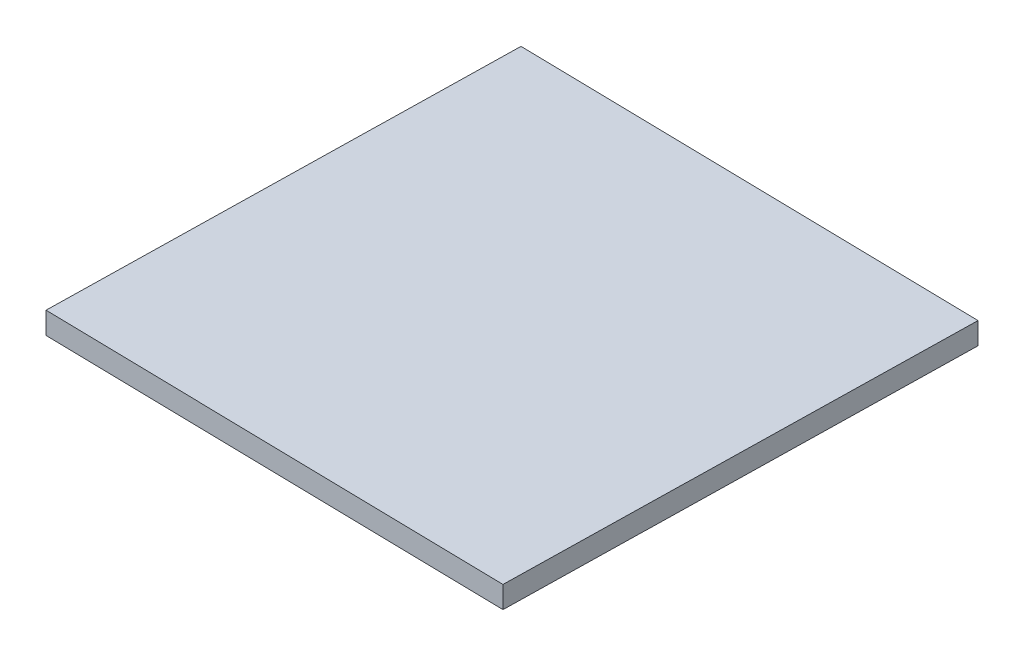
ISO-10303-21;
HEADER;
FILE_DESCRIPTION(('STEP AP214'),'2;1');
FILE_NAME('part.step','',(''),(''),'','','');
FILE_SCHEMA(('AUTOMOTIVE_DESIGN { 1 0 10303 214 1 1 1 1 }'));
ENDSEC;
DATA;
#1=APPLICATION_CONTEXT('core data for automotive mechanical design processes');
#2=APPLICATION_PROTOCOL_DEFINITION('international standard','automotive_design',2000,#1);
#3=PRODUCT_CONTEXT('',#1,'mechanical');
#4=PRODUCT('Part','Part','',(#3));
#5=PRODUCT_RELATED_PRODUCT_CATEGORY('part','',(#4));
#6=PRODUCT_DEFINITION_FORMATION('','',#4);
#7=PRODUCT_DEFINITION_CONTEXT('part definition',#1,'design');
#8=PRODUCT_DEFINITION('design','',#6,#7);
#9=PRODUCT_DEFINITION_SHAPE('','',#8);
#10=(LENGTH_UNIT() NAMED_UNIT(*) SI_UNIT(.MILLI.,.METRE.));
#11=(NAMED_UNIT(*) PLANE_ANGLE_UNIT() SI_UNIT($,.RADIAN.));
#12=(NAMED_UNIT(*) SI_UNIT($,.STERADIAN.) SOLID_ANGLE_UNIT());
#13=UNCERTAINTY_MEASURE_WITH_UNIT(LENGTH_MEASURE(1.E-05),#10,'distance_accuracy_value','');
#14=(GEOMETRIC_REPRESENTATION_CONTEXT(3) GLOBAL_UNCERTAINTY_ASSIGNED_CONTEXT((#13)) GLOBAL_UNIT_ASSIGNED_CONTEXT((#10,
#11,#12)) REPRESENTATION_CONTEXT('',''));
#15=CARTESIAN_POINT('',(0.,0.,0.));
#16=DIRECTION('',(0.,0.,1.));
#17=DIRECTION('',(1.,0.,0.));
#18=AXIS2_PLACEMENT_3D('',#15,#16,#17);
#19=CARTESIAN_POINT('',(-0.359511315449533,8.17060732929215,31.2350567671466));
#20=DIRECTION('',(0.,-1.,0.));
#21=DIRECTION('',(-1.,0.,0.));
#22=AXIS2_PLACEMENT_3D('',#19,#20,#21);
#23=PLANE('',#22);
#24=DIRECTION('',(0.999812677663925,0.,0.0193548335692301));
#25=VECTOR('',#24,1.);
#26=CARTESIAN_POINT('',(7.92428221585353,8.17060732929178,23.2658954103449));
#27=LINE('',#26,#25);
#28=CARTESIAN_POINT('',(-8.32867267225122,8.17060732929188,22.9512632358435));
#29=VERTEX_POINT('',#28);
#30=CARTESIAN_POINT('',(7.92428221585355,8.17060732929203,23.2658954103449));
#31=VERTEX_POINT('',#30);
#32=EDGE_CURVE('E83',#29,#31,#27,.T.);
#33=ORIENTED_EDGE('',*,*,#32,.T.);
#34=DIRECTION('',(-0.0193548335692301,0.,0.999812677663925));
#35=VECTOR('',#34,1.);
#36=CARTESIAN_POINT('',(7.60965004135215,8.1706073292923,39.5188502984497));
#37=LINE('',#36,#35);
#38=CARTESIAN_POINT('',(7.60965004135214,8.17060732929247,39.5188502984497));
#39=VERTEX_POINT('',#38);
#40=EDGE_CURVE('E59',#31,#39,#37,.T.);
#41=ORIENTED_EDGE('',*,*,#40,.T.);
#42=DIRECTION('',(-0.999812677663925,0.,-0.0193548335692301));
#43=VECTOR('',#42,1.);
#44=CARTESIAN_POINT('',(7.60965004135212,8.17060732929251,39.5188502984497));
#45=LINE('',#44,#43);
#46=CARTESIAN_POINT('',(-8.64330484675262,8.17060732929226,39.2042181239483));
#47=VERTEX_POINT('',#46);
#48=EDGE_CURVE('E20',#39,#47,#45,.T.);
#49=ORIENTED_EDGE('',*,*,#48,.T.);
#50=DIRECTION('',(0.0193548335692301,0.,-0.999812677663925));
#51=VECTOR('',#50,1.);
#52=CARTESIAN_POINT('',(-8.64330484675262,8.17060732929199,39.2042181239483));
#53=LINE('',#52,#51);
#54=EDGE_CURVE('E56',#47,#29,#53,.T.);
#55=ORIENTED_EDGE('',*,*,#54,.T.);
#56=EDGE_LOOP('',(#33,#41,#49,#55));
#57=FACE_BOUND('',#56,.T.);
#58=ADVANCED_FACE('F17',(#57),#23,.T.);
#59=CARTESIAN_POINT('',(7.60965004135212,8.93260732929252,39.5188502984497));
#60=DIRECTION('',(0.0193548335692301,0.,-0.999812677663925));
#61=DIRECTION('',(-0.999812677663925,0.,-0.0193548335692301));
#62=AXIS2_PLACEMENT_3D('',#59,#60,#61);
#63=PLANE('',#62);
#64=ORIENTED_EDGE('',*,*,#48,.F.);
#65=DIRECTION('',(0.,1.,0.));
#66=VECTOR('',#65,1.);
#67=CARTESIAN_POINT('',(7.60965004135212,8.93260732929252,39.5188502984497));
#68=LINE('',#67,#66);
#69=CARTESIAN_POINT('',(7.60965004135212,8.93260732929226,39.5188502984497));
#70=VERTEX_POINT('',#69);
#71=EDGE_CURVE('E90',#39,#70,#68,.T.);
#72=ORIENTED_EDGE('',*,*,#71,.T.);
#73=DIRECTION('',(-0.999812677663925,0.,-0.0193548335692302));
#74=VECTOR('',#73,1.);
#75=CARTESIAN_POINT('',(7.60965004135212,8.93260732929253,39.5188502984497));
#76=LINE('',#75,#74);
#77=CARTESIAN_POINT('',(-8.64330484675263,8.93260732929194,39.2042181239483));
#78=VERTEX_POINT('',#77);
#79=EDGE_CURVE('E76',#70,#78,#76,.T.);
#80=ORIENTED_EDGE('',*,*,#79,.T.);
#81=DIRECTION('',(0.,1.,0.));
#82=VECTOR('',#81,1.);
#83=CARTESIAN_POINT('',(-8.64330484675264,8.93260732929199,39.2042181239483));
#84=LINE('',#83,#82);
#85=EDGE_CURVE('E65',#78,#47,#84,.F.);
#86=ORIENTED_EDGE('',*,*,#85,.T.);
#87=EDGE_LOOP('',(#64,#72,#80,#86));
#88=FACE_BOUND('',#87,.T.);
#89=ADVANCED_FACE('F75',(#88),#63,.F.);
#90=CARTESIAN_POINT('',(-8.64330484675264,8.93260732929199,39.2042181239483));
#91=DIRECTION('',(0.999812677663925,0.,0.0193548335692301));
#92=DIRECTION('',(0.0193548335692301,0.,-0.999812677663925));
#93=AXIS2_PLACEMENT_3D('',#90,#91,#92);
#94=PLANE('',#93);
#95=ORIENTED_EDGE('',*,*,#54,.F.);
#96=ORIENTED_EDGE('',*,*,#85,.F.);
#97=DIRECTION('',(0.0193548335692302,0.,-0.999812677663925));
#98=VECTOR('',#97,1.);
#99=CARTESIAN_POINT('',(-8.64330484675264,8.932607329292,39.2042181239483));
#100=LINE('',#99,#98);
#101=CARTESIAN_POINT('',(-8.32867267225124,8.93260732929191,22.9512632358435));
#102=VERTEX_POINT('',#101);
#103=EDGE_CURVE('E94',#78,#102,#100,.T.);
#104=ORIENTED_EDGE('',*,*,#103,.T.);
#105=DIRECTION('',(0.,1.,0.));
#106=VECTOR('',#105,1.);
#107=CARTESIAN_POINT('',(-8.32867267225124,8.9326073292923,22.9512632358435));
#108=LINE('',#107,#106);
#109=EDGE_CURVE('E71',#102,#29,#108,.F.);
#110=ORIENTED_EDGE('',*,*,#109,.T.);
#111=EDGE_LOOP('',(#95,#96,#104,#110));
#112=FACE_BOUND('',#111,.T.);
#113=ADVANCED_FACE('F68',(#112),#94,.F.);
#114=CARTESIAN_POINT('',(7.92428221585353,8.9326073292923,23.2658954103449));
#115=DIRECTION('',(-0.0193548335692301,0.,0.999812677663925));
#116=DIRECTION('',(0.999812677663925,0.,0.0193548335692301));
#117=AXIS2_PLACEMENT_3D('',#114,#115,#116);
#118=PLANE('',#117);
#119=ORIENTED_EDGE('',*,*,#32,.F.);
#120=ORIENTED_EDGE('',*,*,#109,.F.);
#121=DIRECTION('',(0.999812677663925,0.,0.0193548335692302));
#122=VECTOR('',#121,1.);
#123=CARTESIAN_POINT('',(-8.32867267225124,8.93260732929178,22.9512632358435));
#124=LINE('',#123,#122);
#125=CARTESIAN_POINT('',(7.92428221585354,8.93260732929235,23.2658954103449));
#126=VERTEX_POINT('',#125);
#127=EDGE_CURVE('E27',#102,#126,#124,.T.);
#128=ORIENTED_EDGE('',*,*,#127,.T.);
#129=DIRECTION('',(0.,1.,0.));
#130=VECTOR('',#129,1.);
#131=CARTESIAN_POINT('',(7.92428221585353,8.93260732929252,23.2658954103449));
#132=LINE('',#131,#130);
#133=EDGE_CURVE('E35',#126,#31,#132,.F.);
#134=ORIENTED_EDGE('',*,*,#133,.T.);
#135=EDGE_LOOP('',(#119,#120,#128,#134));
#136=FACE_BOUND('',#135,.T.);
#137=ADVANCED_FACE('F101',(#136),#118,.F.);
#138=CARTESIAN_POINT('',(7.60965004135212,8.93260732929252,39.5188502984497));
#139=DIRECTION('',(-0.999812677663925,0.,-0.0193548335692301));
#140=DIRECTION('',(-0.0193548335692301,0.,0.999812677663925));
#141=AXIS2_PLACEMENT_3D('',#138,#139,#140);
#142=PLANE('',#141);
#143=ORIENTED_EDGE('',*,*,#40,.F.);
#144=ORIENTED_EDGE('',*,*,#133,.F.);
#145=DIRECTION('',(-0.0193548335692302,0.,0.999812677663925));
#146=VECTOR('',#145,1.);
#147=CARTESIAN_POINT('',(7.92428221585353,8.9326073292923,23.2658954103449));
#148=LINE('',#147,#146);
#149=EDGE_CURVE('E11',#126,#70,#148,.T.);
#150=ORIENTED_EDGE('',*,*,#149,.T.);
#151=ORIENTED_EDGE('',*,*,#71,.F.);
#152=EDGE_LOOP('',(#143,#144,#150,#151));
#153=FACE_BOUND('',#152,.T.);
#154=ADVANCED_FACE('F104',(#153),#142,.F.);
#155=CARTESIAN_POINT('',(-0.359511315449557,8.93260732929215,31.2350567671466));
#156=DIRECTION('',(0.,-1.,0.));
#157=DIRECTION('',(-1.,0.,0.));
#158=AXIS2_PLACEMENT_3D('',#155,#156,#157);
#159=PLANE('',#158);
#160=ORIENTED_EDGE('',*,*,#127,.F.);
#161=ORIENTED_EDGE('',*,*,#103,.F.);
#162=ORIENTED_EDGE('',*,*,#79,.F.);
#163=ORIENTED_EDGE('',*,*,#149,.F.);
#164=EDGE_LOOP('',(#160,#161,#162,#163));
#165=FACE_BOUND('',#164,.T.);
#166=ADVANCED_FACE('F103',(#165),#159,.F.);
#167=CLOSED_SHELL('',(#58,#89,#113,#137,#154,#166));
#168=MANIFOLD_SOLID_BREP('B1',#167);
#169=ADVANCED_BREP_SHAPE_REPRESENTATION('',(#18,#168),#14);
#170=SHAPE_DEFINITION_REPRESENTATION(#9,#169);
ENDSEC;
END-ISO-10303-21;
